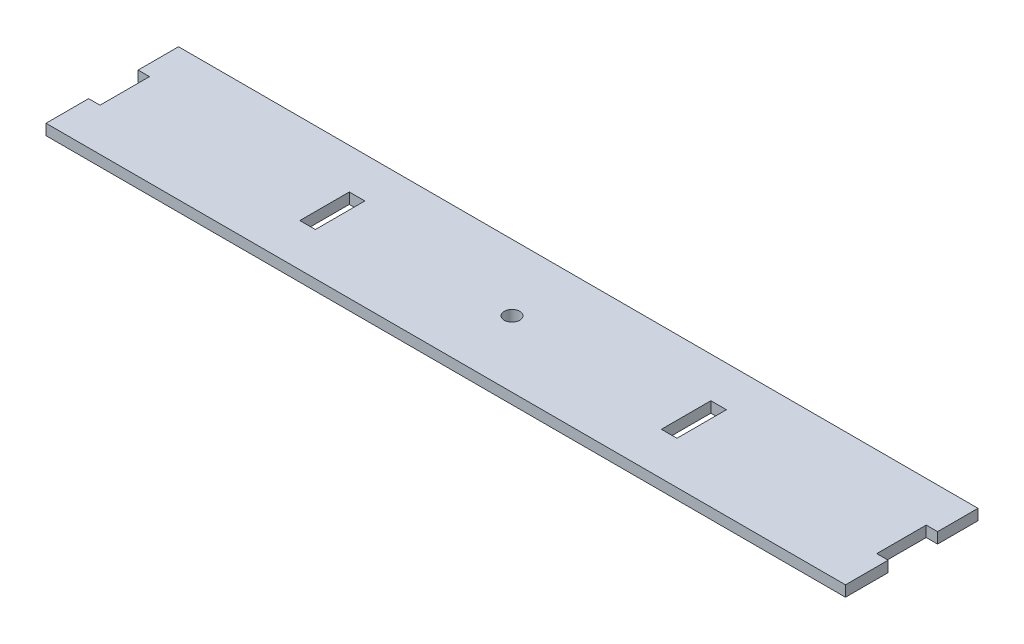
ISO-10303-21;
HEADER;
FILE_DESCRIPTION(('STEP AP214'),'2;1');
FILE_NAME('part.step','',(''),(''),'','','');
FILE_SCHEMA(('AUTOMOTIVE_DESIGN { 1 0 10303 214 1 1 1 1 }'));
ENDSEC;
DATA;
#1=APPLICATION_CONTEXT('core data for automotive mechanical design processes');
#2=APPLICATION_PROTOCOL_DEFINITION('international standard','automotive_design',2000,#1);
#3=PRODUCT_CONTEXT('',#1,'mechanical');
#4=PRODUCT('Part','Part','',(#3));
#5=PRODUCT_RELATED_PRODUCT_CATEGORY('part','',(#4));
#6=PRODUCT_DEFINITION_FORMATION('','',#4);
#7=PRODUCT_DEFINITION_CONTEXT('part definition',#1,'design');
#8=PRODUCT_DEFINITION('design','',#6,#7);
#9=PRODUCT_DEFINITION_SHAPE('','',#8);
#10=(LENGTH_UNIT() NAMED_UNIT(*) SI_UNIT(.MILLI.,.METRE.));
#11=(NAMED_UNIT(*) PLANE_ANGLE_UNIT() SI_UNIT($,.RADIAN.));
#12=(NAMED_UNIT(*) SI_UNIT($,.STERADIAN.) SOLID_ANGLE_UNIT());
#13=UNCERTAINTY_MEASURE_WITH_UNIT(LENGTH_MEASURE(1.E-05),#10,'distance_accuracy_value','');
#14=(GEOMETRIC_REPRESENTATION_CONTEXT(3) GLOBAL_UNCERTAINTY_ASSIGNED_CONTEXT((#13)) GLOBAL_UNIT_ASSIGNED_CONTEXT((#10,
#11,#12)) REPRESENTATION_CONTEXT('',''));
#15=CARTESIAN_POINT('',(0.,0.,0.));
#16=DIRECTION('',(0.,0.,1.));
#17=DIRECTION('',(1.,0.,0.));
#18=AXIS2_PLACEMENT_3D('',#15,#16,#17);
#19=CARTESIAN_POINT('',(0.,4.7625,0.));
#20=DIRECTION('',(0.,1.,0.));
#21=DIRECTION('',(0.,0.,1.));
#22=AXIS2_PLACEMENT_3D('',#19,#20,#21);
#23=PLANE('',#22);
#24=CARTESIAN_POINT('',(0.,4.76250000000001,0.));
#25=DIRECTION('',(0.,-1.,0.));
#26=DIRECTION('',(0.,0.,-1.));
#27=AXIS2_PLACEMENT_3D('',#24,#25,#26);
#28=CIRCLE('',#27,3.429);
#29=CARTESIAN_POINT('',(0.,4.76250000000001,-3.429));
#30=VERTEX_POINT('',#29);
#31=EDGE_CURVE('E198',#30,#30,#28,.T.);
#32=ORIENTED_EDGE('',*,*,#31,.T.);
#33=EDGE_LOOP('',(#32));
#34=FACE_BOUND('',#33,.T.);
#35=DIRECTION('',(0.,0.,1.));
#36=VECTOR('',#35,1.);
#37=CARTESIAN_POINT('',(83.1215,4.76250000000001,-11.392929343963));
#38=LINE('',#37,#36);
#39=CARTESIAN_POINT('',(83.1215,4.76250000000001,-11.392929343963));
#40=VERTEX_POINT('',#39);
#41=CARTESIAN_POINT('',(83.1215,4.76250000000001,10.414));
#42=VERTEX_POINT('',#41);
#43=EDGE_CURVE('E175',#40,#42,#38,.T.);
#44=ORIENTED_EDGE('',*,*,#43,.T.);
#45=DIRECTION('',(-1.,0.,0.));
#46=VECTOR('',#45,1.);
#47=CARTESIAN_POINT('',(75.946,4.7625,10.414));
#48=LINE('',#47,#46);
#49=CARTESIAN_POINT('',(76.2635,4.7625,10.414));
#50=VERTEX_POINT('',#49);
#51=EDGE_CURVE('E181',#42,#50,#48,.T.);
#52=ORIENTED_EDGE('',*,*,#51,.T.);
#53=DIRECTION('',(0.,0.,1.));
#54=VECTOR('',#53,1.);
#55=CARTESIAN_POINT('',(76.2635,4.7625,-11.392929343963));
#56=LINE('',#55,#54);
#57=CARTESIAN_POINT('',(76.2635,4.7625,-11.392929343963));
#58=VERTEX_POINT('',#57);
#59=EDGE_CURVE('E177',#58,#50,#56,.T.);
#60=ORIENTED_EDGE('',*,*,#59,.F.);
#61=DIRECTION('',(1.,0.,0.));
#62=VECTOR('',#61,1.);
#63=CARTESIAN_POINT('',(75.946,4.7625,-11.392929343963));
#64=LINE('',#63,#62);
#65=EDGE_CURVE('E171',#58,#40,#64,.T.);
#66=ORIENTED_EDGE('',*,*,#65,.T.);
#67=EDGE_LOOP('',(#44,#52,#60,#66));
#68=FACE_BOUND('',#67,.T.);
#69=DIRECTION('',(0.,0.,-1.));
#70=VECTOR('',#69,1.);
#71=CARTESIAN_POINT('',(-83.1215,4.76250000000001,-11.392929343963));
#72=LINE('',#71,#70);
#73=CARTESIAN_POINT('',(-83.1215,4.76250000000001,10.414));
#74=VERTEX_POINT('',#73);
#75=CARTESIAN_POINT('',(-83.1215,4.76250000000001,-11.392929343963));
#76=VERTEX_POINT('',#75);
#77=EDGE_CURVE('E206',#74,#76,#72,.T.);
#78=ORIENTED_EDGE('',*,*,#77,.T.);
#79=DIRECTION('',(1.,0.,0.));
#80=VECTOR('',#79,1.);
#81=CARTESIAN_POINT('',(-82.804,4.7625,-11.392929343963));
#82=LINE('',#81,#80);
#83=CARTESIAN_POINT('',(-76.2635,4.7625,-11.392929343963));
#84=VERTEX_POINT('',#83);
#85=EDGE_CURVE('E280',#76,#84,#82,.T.);
#86=ORIENTED_EDGE('',*,*,#85,.T.);
#87=DIRECTION('',(0.,0.,-1.));
#88=VECTOR('',#87,1.);
#89=CARTESIAN_POINT('',(-76.2635,4.7625,-11.392929343963));
#90=LINE('',#89,#88);
#91=CARTESIAN_POINT('',(-76.2635,4.76250000000001,10.414));
#92=VERTEX_POINT('',#91);
#93=EDGE_CURVE('E50',#92,#84,#90,.T.);
#94=ORIENTED_EDGE('',*,*,#93,.F.);
#95=DIRECTION('',(-1.,0.,0.));
#96=VECTOR('',#95,1.);
#97=CARTESIAN_POINT('',(-82.804,4.7625,10.414));
#98=LINE('',#97,#96);
#99=EDGE_CURVE('E180',#92,#74,#98,.T.);
#100=ORIENTED_EDGE('',*,*,#99,.T.);
#101=EDGE_LOOP('',(#78,#86,#94,#100));
#102=FACE_BOUND('',#101,.T.);
#103=DIRECTION('',(-1.,0.,0.));
#104=VECTOR('',#103,1.);
#105=CARTESIAN_POINT('',(-171.196,4.7625,10.414));
#106=LINE('',#105,#104);
#107=CARTESIAN_POINT('',(-171.196,4.7625,10.414));
#108=VERTEX_POINT('',#107);
#109=CARTESIAN_POINT('',(-176.2125,4.7625,10.414));
#110=VERTEX_POINT('',#109);
#111=EDGE_CURVE('E288',#108,#110,#106,.T.);
#112=ORIENTED_EDGE('',*,*,#111,.T.);
#113=DIRECTION('',(0.,0.,-1.));
#114=VECTOR('',#113,1.);
#115=CARTESIAN_POINT('',(-176.2125,4.7625,0.));
#116=LINE('',#115,#114);
#117=CARTESIAN_POINT('',(-176.2125,4.7625,29.21));
#118=VERTEX_POINT('',#117);
#119=EDGE_CURVE('E234',#118,#110,#116,.T.);
#120=ORIENTED_EDGE('',*,*,#119,.F.);
#121=DIRECTION('',(1.,0.,0.));
#122=VECTOR('',#121,1.);
#123=CARTESIAN_POINT('',(-177.8,4.7625,29.21));
#124=LINE('',#123,#122);
#125=CARTESIAN_POINT('',(176.2125,4.7625,29.21));
#126=VERTEX_POINT('',#125);
#127=EDGE_CURVE('E281',#118,#126,#124,.T.);
#128=ORIENTED_EDGE('',*,*,#127,.T.);
#129=DIRECTION('',(0.,0.,1.));
#130=VECTOR('',#129,1.);
#131=CARTESIAN_POINT('',(176.2125,4.7625,0.));
#132=LINE('',#131,#130);
#133=CARTESIAN_POINT('',(176.2125,4.7625,10.414));
#134=VERTEX_POINT('',#133);
#135=EDGE_CURVE('E254',#134,#126,#132,.T.);
#136=ORIENTED_EDGE('',*,*,#135,.F.);
#137=DIRECTION('',(-1.,0.,0.));
#138=VECTOR('',#137,1.);
#139=CARTESIAN_POINT('',(171.196,4.7625,10.414));
#140=LINE('',#139,#138);
#141=CARTESIAN_POINT('',(171.196,4.7625,10.414));
#142=VERTEX_POINT('',#141);
#143=EDGE_CURVE('E37',#134,#142,#140,.T.);
#144=ORIENTED_EDGE('',*,*,#143,.T.);
#145=DIRECTION('',(0.,0.,-1.));
#146=VECTOR('',#145,1.);
#147=CARTESIAN_POINT('',(171.196,4.7625,10.414));
#148=LINE('',#147,#146);
#149=CARTESIAN_POINT('',(171.196,4.7625,-11.3929293439582));
#150=VERTEX_POINT('',#149);
#151=EDGE_CURVE('E332',#142,#150,#148,.T.);
#152=ORIENTED_EDGE('',*,*,#151,.T.);
#153=DIRECTION('',(1.,0.,0.));
#154=VECTOR('',#153,1.);
#155=CARTESIAN_POINT('',(171.196,4.7625,-11.3929293439582));
#156=LINE('',#155,#154);
#157=CARTESIAN_POINT('',(176.2125,4.7625,-11.3929293439582));
#158=VERTEX_POINT('',#157);
#159=EDGE_CURVE('E312',#150,#158,#156,.T.);
#160=ORIENTED_EDGE('',*,*,#159,.T.);
#161=DIRECTION('',(0.,0.,1.));
#162=VECTOR('',#161,1.);
#163=CARTESIAN_POINT('',(176.2125,4.7625,0.));
#164=LINE('',#163,#162);
#165=CARTESIAN_POINT('',(176.2125,4.7625,-29.21));
#166=VERTEX_POINT('',#165);
#167=EDGE_CURVE('E266',#166,#158,#164,.T.);
#168=ORIENTED_EDGE('',*,*,#167,.F.);
#169=DIRECTION('',(-1.,0.,0.));
#170=VECTOR('',#169,1.);
#171=CARTESIAN_POINT('',(-177.8,4.7625,-29.21));
#172=LINE('',#171,#170);
#173=CARTESIAN_POINT('',(-176.2125,4.7625,-29.21));
#174=VERTEX_POINT('',#173);
#175=EDGE_CURVE('E294',#166,#174,#172,.T.);
#176=ORIENTED_EDGE('',*,*,#175,.T.);
#177=DIRECTION('',(0.,0.,-1.));
#178=VECTOR('',#177,1.);
#179=CARTESIAN_POINT('',(-176.2125,4.7625,0.));
#180=LINE('',#179,#178);
#181=CARTESIAN_POINT('',(-176.2125,4.7625,-11.392929343963));
#182=VERTEX_POINT('',#181);
#183=EDGE_CURVE('E244',#182,#174,#180,.T.);
#184=ORIENTED_EDGE('',*,*,#183,.F.);
#185=DIRECTION('',(1.,0.,0.));
#186=VECTOR('',#185,1.);
#187=CARTESIAN_POINT('',(-171.196,4.7625,-11.392929343963));
#188=LINE('',#187,#186);
#189=CARTESIAN_POINT('',(-171.196,4.7625,-11.392929343963));
#190=VERTEX_POINT('',#189);
#191=EDGE_CURVE('E292',#182,#190,#188,.T.);
#192=ORIENTED_EDGE('',*,*,#191,.T.);
#193=DIRECTION('',(0.,0.,1.));
#194=VECTOR('',#193,1.);
#195=CARTESIAN_POINT('',(-171.196,4.7625,10.414));
#196=LINE('',#195,#194);
#197=EDGE_CURVE('E291',#190,#108,#196,.T.);
#198=ORIENTED_EDGE('',*,*,#197,.T.);
#199=EDGE_LOOP('',(#112,#120,#128,#136,#144,#152,#160,#168,#176,#184,#192,#198));
#200=FACE_BOUND('',#199,.T.);
#201=ADVANCED_FACE('F33',(#34,#68,#102,#200),#23,.T.);
#202=CARTESIAN_POINT('',(0.,0.,0.));
#203=DIRECTION('',(0.,1.,0.));
#204=DIRECTION('',(0.,0.,1.));
#205=AXIS2_PLACEMENT_3D('',#202,#203,#204);
#206=PLANE('',#205);
#207=CARTESIAN_POINT('',(0.,0.,0.));
#208=DIRECTION('',(0.,-1.,0.));
#209=DIRECTION('',(0.,0.,-1.));
#210=AXIS2_PLACEMENT_3D('',#207,#208,#209);
#211=CIRCLE('',#210,3.429);
#212=CARTESIAN_POINT('',(0.,0.,-3.429));
#213=VERTEX_POINT('',#212);
#214=EDGE_CURVE('E201',#213,#213,#211,.T.);
#215=ORIENTED_EDGE('',*,*,#214,.F.);
#216=EDGE_LOOP('',(#215));
#217=FACE_BOUND('',#216,.T.);
#218=DIRECTION('',(1.,0.,0.));
#219=VECTOR('',#218,1.);
#220=CARTESIAN_POINT('',(-82.804,0.,-11.392929343963));
#221=LINE('',#220,#219);
#222=CARTESIAN_POINT('',(-83.1215,0.,-11.392929343963));
#223=VERTEX_POINT('',#222);
#224=CARTESIAN_POINT('',(-76.2635,0.,-11.392929343963));
#225=VERTEX_POINT('',#224);
#226=EDGE_CURVE('E285',#223,#225,#221,.T.);
#227=ORIENTED_EDGE('',*,*,#226,.F.);
#228=DIRECTION('',(0.,0.,-1.));
#229=VECTOR('',#228,1.);
#230=CARTESIAN_POINT('',(-83.1215,0.,-11.392929343963));
#231=LINE('',#230,#229);
#232=CARTESIAN_POINT('',(-83.1215,0.,10.414));
#233=VERTEX_POINT('',#232);
#234=EDGE_CURVE('E204',#233,#223,#231,.T.);
#235=ORIENTED_EDGE('',*,*,#234,.F.);
#236=DIRECTION('',(-1.,0.,0.));
#237=VECTOR('',#236,1.);
#238=CARTESIAN_POINT('',(-82.804,0.,10.414));
#239=LINE('',#238,#237);
#240=CARTESIAN_POINT('',(-76.2635,0.,10.414));
#241=VERTEX_POINT('',#240);
#242=EDGE_CURVE('E308',#241,#233,#239,.T.);
#243=ORIENTED_EDGE('',*,*,#242,.F.);
#244=DIRECTION('',(0.,0.,-1.));
#245=VECTOR('',#244,1.);
#246=CARTESIAN_POINT('',(-76.2635,0.,-11.392929343963));
#247=LINE('',#246,#245);
#248=EDGE_CURVE('E215',#241,#225,#247,.T.);
#249=ORIENTED_EDGE('',*,*,#248,.T.);
#250=EDGE_LOOP('',(#227,#235,#243,#249));
#251=FACE_BOUND('',#250,.T.);
#252=DIRECTION('',(-1.,0.,0.));
#253=VECTOR('',#252,1.);
#254=CARTESIAN_POINT('',(75.946,0.,10.414));
#255=LINE('',#254,#253);
#256=CARTESIAN_POINT('',(83.1215,0.,10.414));
#257=VERTEX_POINT('',#256);
#258=CARTESIAN_POINT('',(76.2635,0.,10.414));
#259=VERTEX_POINT('',#258);
#260=EDGE_CURVE('E283',#257,#259,#255,.T.);
#261=ORIENTED_EDGE('',*,*,#260,.F.);
#262=DIRECTION('',(0.,0.,1.));
#263=VECTOR('',#262,1.);
#264=CARTESIAN_POINT('',(83.1215,0.,-11.392929343963));
#265=LINE('',#264,#263);
#266=CARTESIAN_POINT('',(83.1215,0.,-11.392929343963));
#267=VERTEX_POINT('',#266);
#268=EDGE_CURVE('E196',#267,#257,#265,.T.);
#269=ORIENTED_EDGE('',*,*,#268,.F.);
#270=DIRECTION('',(1.,0.,0.));
#271=VECTOR('',#270,1.);
#272=CARTESIAN_POINT('',(75.946,0.,-11.392929343963));
#273=LINE('',#272,#271);
#274=CARTESIAN_POINT('',(76.2635,0.,-11.392929343963));
#275=VERTEX_POINT('',#274);
#276=EDGE_CURVE('E187',#275,#267,#273,.T.);
#277=ORIENTED_EDGE('',*,*,#276,.F.);
#278=DIRECTION('',(0.,0.,1.));
#279=VECTOR('',#278,1.);
#280=CARTESIAN_POINT('',(76.2635,0.,-11.392929343963));
#281=LINE('',#280,#279);
#282=EDGE_CURVE('E224',#275,#259,#281,.T.);
#283=ORIENTED_EDGE('',*,*,#282,.T.);
#284=EDGE_LOOP('',(#261,#269,#277,#283));
#285=FACE_BOUND('',#284,.T.);
#286=DIRECTION('',(0.,0.,-1.));
#287=VECTOR('',#286,1.);
#288=CARTESIAN_POINT('',(-176.2125,0.,0.));
#289=LINE('',#288,#287);
#290=CARTESIAN_POINT('',(-176.2125,0.,29.21));
#291=VERTEX_POINT('',#290);
#292=CARTESIAN_POINT('',(-176.2125,0.,10.414));
#293=VERTEX_POINT('',#292);
#294=EDGE_CURVE('E232',#291,#293,#289,.T.);
#295=ORIENTED_EDGE('',*,*,#294,.T.);
#296=DIRECTION('',(-1.,0.,0.));
#297=VECTOR('',#296,1.);
#298=CARTESIAN_POINT('',(-171.196,0.,10.414));
#299=LINE('',#298,#297);
#300=CARTESIAN_POINT('',(-171.196,0.,10.414));
#301=VERTEX_POINT('',#300);
#302=EDGE_CURVE('E297',#301,#293,#299,.T.);
#303=ORIENTED_EDGE('',*,*,#302,.F.);
#304=DIRECTION('',(0.,0.,1.));
#305=VECTOR('',#304,1.);
#306=CARTESIAN_POINT('',(-171.196,0.,10.414));
#307=LINE('',#306,#305);
#308=CARTESIAN_POINT('',(-171.196,0.,-11.392929343963));
#309=VERTEX_POINT('',#308);
#310=EDGE_CURVE('E300',#309,#301,#307,.T.);
#311=ORIENTED_EDGE('',*,*,#310,.F.);
#312=DIRECTION('',(-1.,0.,0.));
#313=VECTOR('',#312,1.);
#314=CARTESIAN_POINT('',(0.,0.,-11.392929343963));
#315=LINE('',#314,#313);
#316=CARTESIAN_POINT('',(-176.2125,0.,-11.392929343963));
#317=VERTEX_POINT('',#316);
#318=EDGE_CURVE('E279',#309,#317,#315,.T.);
#319=ORIENTED_EDGE('',*,*,#318,.T.);
#320=DIRECTION('',(0.,0.,-1.));
#321=VECTOR('',#320,1.);
#322=CARTESIAN_POINT('',(-176.2125,0.,0.));
#323=LINE('',#322,#321);
#324=CARTESIAN_POINT('',(-176.2125,0.,-29.21));
#325=VERTEX_POINT('',#324);
#326=EDGE_CURVE('E241',#317,#325,#323,.T.);
#327=ORIENTED_EDGE('',*,*,#326,.T.);
#328=DIRECTION('',(-1.,0.,0.));
#329=VECTOR('',#328,1.);
#330=CARTESIAN_POINT('',(-177.8,0.,-29.21));
#331=LINE('',#330,#329);
#332=CARTESIAN_POINT('',(176.2125,0.,-29.21));
#333=VERTEX_POINT('',#332);
#334=EDGE_CURVE('E314',#333,#325,#331,.T.);
#335=ORIENTED_EDGE('',*,*,#334,.F.);
#336=DIRECTION('',(0.,0.,1.));
#337=VECTOR('',#336,1.);
#338=CARTESIAN_POINT('',(176.2125,0.,0.));
#339=LINE('',#338,#337);
#340=CARTESIAN_POINT('',(176.2125,0.,-11.3929293439582));
#341=VERTEX_POINT('',#340);
#342=EDGE_CURVE('E263',#333,#341,#339,.T.);
#343=ORIENTED_EDGE('',*,*,#342,.T.);
#344=DIRECTION('',(1.,0.,0.));
#345=VECTOR('',#344,1.);
#346=CARTESIAN_POINT('',(171.196,0.,-11.3929293439582));
#347=LINE('',#346,#345);
#348=CARTESIAN_POINT('',(171.196,0.,-11.3929293439582));
#349=VERTEX_POINT('',#348);
#350=EDGE_CURVE('E326',#349,#341,#347,.T.);
#351=ORIENTED_EDGE('',*,*,#350,.F.);
#352=DIRECTION('',(0.,0.,-1.));
#353=VECTOR('',#352,1.);
#354=CARTESIAN_POINT('',(171.196,0.,10.414));
#355=LINE('',#354,#353);
#356=CARTESIAN_POINT('',(171.196,0.,10.414));
#357=VERTEX_POINT('',#356);
#358=EDGE_CURVE('E42',#357,#349,#355,.T.);
#359=ORIENTED_EDGE('',*,*,#358,.F.);
#360=DIRECTION('',(1.,0.,0.));
#361=VECTOR('',#360,1.);
#362=CARTESIAN_POINT('',(0.,0.,10.414));
#363=LINE('',#362,#361);
#364=CARTESIAN_POINT('',(176.2125,0.,10.414));
#365=VERTEX_POINT('',#364);
#366=EDGE_CURVE('E276',#357,#365,#363,.T.);
#367=ORIENTED_EDGE('',*,*,#366,.T.);
#368=DIRECTION('',(0.,0.,1.));
#369=VECTOR('',#368,1.);
#370=CARTESIAN_POINT('',(176.2125,0.,0.));
#371=LINE('',#370,#369);
#372=CARTESIAN_POINT('',(176.2125,0.,29.21));
#373=VERTEX_POINT('',#372);
#374=EDGE_CURVE('E251',#365,#373,#371,.T.);
#375=ORIENTED_EDGE('',*,*,#374,.T.);
#376=DIRECTION('',(1.,0.,0.));
#377=VECTOR('',#376,1.);
#378=CARTESIAN_POINT('',(-177.8,0.,29.21));
#379=LINE('',#378,#377);
#380=EDGE_CURVE('E273',#291,#373,#379,.T.);
#381=ORIENTED_EDGE('',*,*,#380,.F.);
#382=EDGE_LOOP('',(#295,#303,#311,#319,#327,#335,#343,#351,#359,#367,#375,#381));
#383=FACE_BOUND('',#382,.T.);
#384=ADVANCED_FACE('F35',(#217,#251,#285,#383),#206,.F.);
#385=CARTESIAN_POINT('',(-177.8,4.7625,29.21));
#386=DIRECTION('',(0.,0.,-1.));
#387=DIRECTION('',(-1.,0.,0.));
#388=AXIS2_PLACEMENT_3D('',#385,#386,#387);
#389=PLANE('',#388);
#390=DIRECTION('',(0.,-1.,0.));
#391=VECTOR('',#390,1.);
#392=CARTESIAN_POINT('',(-176.2125,4.7625,29.21));
#393=LINE('',#392,#391);
#394=EDGE_CURVE('E236',#118,#291,#393,.T.);
#395=ORIENTED_EDGE('',*,*,#394,.T.);
#396=ORIENTED_EDGE('',*,*,#380,.T.);
#397=DIRECTION('',(0.,-1.,0.));
#398=VECTOR('',#397,1.);
#399=CARTESIAN_POINT('',(176.2125,4.7625,29.21));
#400=LINE('',#399,#398);
#401=EDGE_CURVE('E260',#126,#373,#400,.T.);
#402=ORIENTED_EDGE('',*,*,#401,.F.);
#403=ORIENTED_EDGE('',*,*,#127,.F.);
#404=EDGE_LOOP('',(#395,#396,#402,#403));
#405=FACE_BOUND('',#404,.T.);
#406=ADVANCED_FACE('F381',(#405),#389,.F.);
#407=CARTESIAN_POINT('',(-171.196,4.7625,10.414));
#408=DIRECTION('',(0.,0.,1.));
#409=DIRECTION('',(1.,0.,0.));
#410=AXIS2_PLACEMENT_3D('',#407,#408,#409);
#411=PLANE('',#410);
#412=DIRECTION('',(0.,-1.,0.));
#413=VECTOR('',#412,1.);
#414=CARTESIAN_POINT('',(-176.2125,4.7625,10.414));
#415=LINE('',#414,#413);
#416=EDGE_CURVE('E239',#110,#293,#415,.T.);
#417=ORIENTED_EDGE('',*,*,#416,.F.);
#418=ORIENTED_EDGE('',*,*,#111,.F.);
#419=DIRECTION('',(0.,-1.,0.));
#420=VECTOR('',#419,1.);
#421=CARTESIAN_POINT('',(-171.196,4.7625,10.414));
#422=LINE('',#421,#420);
#423=EDGE_CURVE('E301',#108,#301,#422,.T.);
#424=ORIENTED_EDGE('',*,*,#423,.T.);
#425=ORIENTED_EDGE('',*,*,#302,.T.);
#426=EDGE_LOOP('',(#417,#418,#424,#425));
#427=FACE_BOUND('',#426,.T.);
#428=ADVANCED_FACE('F375',(#427),#411,.F.);
#429=CARTESIAN_POINT('',(-177.8,4.7625,-29.21));
#430=DIRECTION('',(0.,0.,1.));
#431=DIRECTION('',(1.,0.,0.));
#432=AXIS2_PLACEMENT_3D('',#429,#430,#431);
#433=PLANE('',#432);
#434=DIRECTION('',(0.,-1.,0.));
#435=VECTOR('',#434,1.);
#436=CARTESIAN_POINT('',(-176.2125,4.7625,-29.21));
#437=LINE('',#436,#435);
#438=EDGE_CURVE('E249',#174,#325,#437,.T.);
#439=ORIENTED_EDGE('',*,*,#438,.F.);
#440=ORIENTED_EDGE('',*,*,#175,.F.);
#441=DIRECTION('',(0.,-1.,0.));
#442=VECTOR('',#441,1.);
#443=CARTESIAN_POINT('',(176.2125,4.7625,-29.21));
#444=LINE('',#443,#442);
#445=EDGE_CURVE('E268',#166,#333,#444,.T.);
#446=ORIENTED_EDGE('',*,*,#445,.T.);
#447=ORIENTED_EDGE('',*,*,#334,.T.);
#448=EDGE_LOOP('',(#439,#440,#446,#447));
#449=FACE_BOUND('',#448,.T.);
#450=ADVANCED_FACE('F356',(#449),#433,.F.);
#451=CARTESIAN_POINT('',(-171.196,4.7625,-11.392929343963));
#452=DIRECTION('',(0.,0.,-1.));
#453=DIRECTION('',(-1.,0.,0.));
#454=AXIS2_PLACEMENT_3D('',#451,#452,#453);
#455=PLANE('',#454);
#456=DIRECTION('',(0.,-1.,0.));
#457=VECTOR('',#456,1.);
#458=CARTESIAN_POINT('',(-176.2125,4.7625,-11.392929343963));
#459=LINE('',#458,#457);
#460=EDGE_CURVE('E246',#182,#317,#459,.T.);
#461=ORIENTED_EDGE('',*,*,#460,.T.);
#462=ORIENTED_EDGE('',*,*,#318,.F.);
#463=DIRECTION('',(0.,-1.,0.));
#464=VECTOR('',#463,1.);
#465=CARTESIAN_POINT('',(-171.196,4.7625,-11.392929343963));
#466=LINE('',#465,#464);
#467=EDGE_CURVE('E304',#190,#309,#466,.T.);
#468=ORIENTED_EDGE('',*,*,#467,.F.);
#469=ORIENTED_EDGE('',*,*,#191,.F.);
#470=EDGE_LOOP('',(#461,#462,#468,#469));
#471=FACE_BOUND('',#470,.T.);
#472=ADVANCED_FACE('F365',(#471),#455,.F.);
#473=CARTESIAN_POINT('',(171.196,4.7625,10.414));
#474=DIRECTION('',(0.,0.,1.));
#475=DIRECTION('',(1.,0.,0.));
#476=AXIS2_PLACEMENT_3D('',#473,#474,#475);
#477=PLANE('',#476);
#478=DIRECTION('',(0.,-1.,0.));
#479=VECTOR('',#478,1.);
#480=CARTESIAN_POINT('',(176.2125,4.7625,10.414));
#481=LINE('',#480,#479);
#482=EDGE_CURVE('E257',#134,#365,#481,.T.);
#483=ORIENTED_EDGE('',*,*,#482,.T.);
#484=ORIENTED_EDGE('',*,*,#366,.F.);
#485=DIRECTION('',(0.,-1.,0.));
#486=VECTOR('',#485,1.);
#487=CARTESIAN_POINT('',(171.196,4.7625,10.414));
#488=LINE('',#487,#486);
#489=EDGE_CURVE('E11',#142,#357,#488,.T.);
#490=ORIENTED_EDGE('',*,*,#489,.F.);
#491=ORIENTED_EDGE('',*,*,#143,.F.);
#492=EDGE_LOOP('',(#483,#484,#490,#491));
#493=FACE_BOUND('',#492,.T.);
#494=ADVANCED_FACE('F341',(#493),#477,.F.);
#495=CARTESIAN_POINT('',(171.196,4.7625,-11.3929293439582));
#496=DIRECTION('',(0.,0.,-1.));
#497=DIRECTION('',(-1.,0.,0.));
#498=AXIS2_PLACEMENT_3D('',#495,#496,#497);
#499=PLANE('',#498);
#500=DIRECTION('',(0.,-1.,0.));
#501=VECTOR('',#500,1.);
#502=CARTESIAN_POINT('',(176.2125,4.7625,-11.3929293439582));
#503=LINE('',#502,#501);
#504=EDGE_CURVE('E271',#158,#341,#503,.T.);
#505=ORIENTED_EDGE('',*,*,#504,.F.);
#506=ORIENTED_EDGE('',*,*,#159,.F.);
#507=DIRECTION('',(0.,-1.,0.));
#508=VECTOR('',#507,1.);
#509=CARTESIAN_POINT('',(171.196,4.7625,-11.3929293439582));
#510=LINE('',#509,#508);
#511=EDGE_CURVE('E287',#150,#349,#510,.T.);
#512=ORIENTED_EDGE('',*,*,#511,.T.);
#513=ORIENTED_EDGE('',*,*,#350,.T.);
#514=EDGE_LOOP('',(#505,#506,#512,#513));
#515=FACE_BOUND('',#514,.T.);
#516=ADVANCED_FACE('F349',(#515),#499,.F.);
#517=CARTESIAN_POINT('',(-171.196,4.7625,10.414));
#518=DIRECTION('',(1.,0.,0.));
#519=DIRECTION('',(0.,0.,-1.));
#520=AXIS2_PLACEMENT_3D('',#517,#518,#519);
#521=PLANE('',#520);
#522=ORIENTED_EDGE('',*,*,#310,.T.);
#523=ORIENTED_EDGE('',*,*,#423,.F.);
#524=ORIENTED_EDGE('',*,*,#197,.F.);
#525=ORIENTED_EDGE('',*,*,#467,.T.);
#526=EDGE_LOOP('',(#522,#523,#524,#525));
#527=FACE_BOUND('',#526,.T.);
#528=ADVANCED_FACE('F369',(#527),#521,.F.);
#529=CARTESIAN_POINT('',(-82.804,4.7625,10.414));
#530=DIRECTION('',(0.,0.,1.));
#531=DIRECTION('',(1.,0.,0.));
#532=AXIS2_PLACEMENT_3D('',#529,#530,#531);
#533=PLANE('',#532);
#534=ORIENTED_EDGE('',*,*,#99,.F.);
#535=DIRECTION('',(0.,-1.,0.));
#536=VECTOR('',#535,1.);
#537=CARTESIAN_POINT('',(-76.2635,26.5717405567593,10.414));
#538=LINE('',#537,#536);
#539=EDGE_CURVE('E220',#92,#241,#538,.T.);
#540=ORIENTED_EDGE('',*,*,#539,.T.);
#541=ORIENTED_EDGE('',*,*,#242,.T.);
#542=DIRECTION('',(0.,-1.,0.));
#543=VECTOR('',#542,1.);
#544=CARTESIAN_POINT('',(-83.1215,4.76250000000001,10.414));
#545=LINE('',#544,#543);
#546=EDGE_CURVE('E209',#74,#233,#545,.T.);
#547=ORIENTED_EDGE('',*,*,#546,.F.);
#548=EDGE_LOOP('',(#534,#540,#541,#547));
#549=FACE_BOUND('',#548,.T.);
#550=ADVANCED_FACE('F411',(#549),#533,.F.);
#551=CARTESIAN_POINT('',(-82.804,4.7625,-11.392929343963));
#552=DIRECTION('',(0.,0.,-1.));
#553=DIRECTION('',(-1.,0.,0.));
#554=AXIS2_PLACEMENT_3D('',#551,#552,#553);
#555=PLANE('',#554);
#556=ORIENTED_EDGE('',*,*,#226,.T.);
#557=DIRECTION('',(0.,-1.,0.));
#558=VECTOR('',#557,1.);
#559=CARTESIAN_POINT('',(-76.2635,26.5717405567593,-11.392929343963));
#560=LINE('',#559,#558);
#561=EDGE_CURVE('E222',#84,#225,#560,.T.);
#562=ORIENTED_EDGE('',*,*,#561,.F.);
#563=ORIENTED_EDGE('',*,*,#85,.F.);
#564=DIRECTION('',(0.,-1.,0.));
#565=VECTOR('',#564,1.);
#566=CARTESIAN_POINT('',(-83.1215,4.76250000000001,-11.392929343963));
#567=LINE('',#566,#565);
#568=EDGE_CURVE('E212',#76,#223,#567,.T.);
#569=ORIENTED_EDGE('',*,*,#568,.T.);
#570=EDGE_LOOP('',(#556,#562,#563,#569));
#571=FACE_BOUND('',#570,.T.);
#572=ADVANCED_FACE('F407',(#571),#555,.F.);
#573=CARTESIAN_POINT('',(75.946,4.7625,10.414));
#574=DIRECTION('',(0.,0.,1.));
#575=DIRECTION('',(1.,0.,0.));
#576=AXIS2_PLACEMENT_3D('',#573,#574,#575);
#577=PLANE('',#576);
#578=ORIENTED_EDGE('',*,*,#260,.T.);
#579=DIRECTION('',(0.,-1.,0.));
#580=VECTOR('',#579,1.);
#581=CARTESIAN_POINT('',(76.2635,26.5717405567593,10.414));
#582=LINE('',#581,#580);
#583=EDGE_CURVE('E58',#50,#259,#582,.T.);
#584=ORIENTED_EDGE('',*,*,#583,.F.);
#585=ORIENTED_EDGE('',*,*,#51,.F.);
#586=DIRECTION('',(0.,-1.,0.));
#587=VECTOR('',#586,1.);
#588=CARTESIAN_POINT('',(83.1215,4.76250000000001,10.414));
#589=LINE('',#588,#587);
#590=EDGE_CURVE('E191',#42,#257,#589,.T.);
#591=ORIENTED_EDGE('',*,*,#590,.T.);
#592=EDGE_LOOP('',(#578,#584,#585,#591));
#593=FACE_BOUND('',#592,.T.);
#594=ADVANCED_FACE('F410',(#593),#577,.F.);
#595=CARTESIAN_POINT('',(75.946,4.7625,-11.392929343963));
#596=DIRECTION('',(0.,0.,-1.));
#597=DIRECTION('',(-1.,0.,0.));
#598=AXIS2_PLACEMENT_3D('',#595,#596,#597);
#599=PLANE('',#598);
#600=ORIENTED_EDGE('',*,*,#65,.F.);
#601=DIRECTION('',(0.,-1.,0.));
#602=VECTOR('',#601,1.);
#603=CARTESIAN_POINT('',(76.2635,26.5717405567593,-11.392929343963));
#604=LINE('',#603,#602);
#605=EDGE_CURVE('E229',#58,#275,#604,.T.);
#606=ORIENTED_EDGE('',*,*,#605,.T.);
#607=ORIENTED_EDGE('',*,*,#276,.T.);
#608=DIRECTION('',(0.,-1.,0.));
#609=VECTOR('',#608,1.);
#610=CARTESIAN_POINT('',(83.1215,4.76250000000001,-11.392929343963));
#611=LINE('',#610,#609);
#612=EDGE_CURVE('E184',#40,#267,#611,.T.);
#613=ORIENTED_EDGE('',*,*,#612,.F.);
#614=EDGE_LOOP('',(#600,#606,#607,#613));
#615=FACE_BOUND('',#614,.T.);
#616=ADVANCED_FACE('F185',(#615),#599,.F.);
#617=CARTESIAN_POINT('',(171.196,4.7625,10.414));
#618=DIRECTION('',(-1.,0.,0.));
#619=DIRECTION('',(0.,0.,1.));
#620=AXIS2_PLACEMENT_3D('',#617,#618,#619);
#621=PLANE('',#620);
#622=ORIENTED_EDGE('',*,*,#358,.T.);
#623=ORIENTED_EDGE('',*,*,#511,.F.);
#624=ORIENTED_EDGE('',*,*,#151,.F.);
#625=ORIENTED_EDGE('',*,*,#489,.T.);
#626=EDGE_LOOP('',(#622,#623,#624,#625));
#627=FACE_BOUND('',#626,.T.);
#628=ADVANCED_FACE('F344',(#627),#621,.F.);
#629=CARTESIAN_POINT('',(176.2125,4.7625,0.));
#630=DIRECTION('',(1.,0.,0.));
#631=DIRECTION('',(0.,0.,-1.));
#632=AXIS2_PLACEMENT_3D('',#629,#630,#631);
#633=PLANE('',#632);
#634=ORIENTED_EDGE('',*,*,#342,.F.);
#635=ORIENTED_EDGE('',*,*,#445,.F.);
#636=ORIENTED_EDGE('',*,*,#167,.T.);
#637=ORIENTED_EDGE('',*,*,#504,.T.);
#638=EDGE_LOOP('',(#634,#635,#636,#637));
#639=FACE_BOUND('',#638,.T.);
#640=ADVANCED_FACE('F384',(#639),#633,.T.);
#641=CARTESIAN_POINT('',(176.2125,4.7625,0.));
#642=DIRECTION('',(1.,0.,0.));
#643=DIRECTION('',(0.,0.,-1.));
#644=AXIS2_PLACEMENT_3D('',#641,#642,#643);
#645=PLANE('',#644);
#646=ORIENTED_EDGE('',*,*,#374,.F.);
#647=ORIENTED_EDGE('',*,*,#482,.F.);
#648=ORIENTED_EDGE('',*,*,#135,.T.);
#649=ORIENTED_EDGE('',*,*,#401,.T.);
#650=EDGE_LOOP('',(#646,#647,#648,#649));
#651=FACE_BOUND('',#650,.T.);
#652=ADVANCED_FACE('F383',(#651),#645,.T.);
#653=CARTESIAN_POINT('',(-176.2125,4.7625,0.));
#654=DIRECTION('',(-1.,0.,0.));
#655=DIRECTION('',(0.,0.,1.));
#656=AXIS2_PLACEMENT_3D('',#653,#654,#655);
#657=PLANE('',#656);
#658=ORIENTED_EDGE('',*,*,#326,.F.);
#659=ORIENTED_EDGE('',*,*,#460,.F.);
#660=ORIENTED_EDGE('',*,*,#183,.T.);
#661=ORIENTED_EDGE('',*,*,#438,.T.);
#662=EDGE_LOOP('',(#658,#659,#660,#661));
#663=FACE_BOUND('',#662,.T.);
#664=ADVANCED_FACE('F359',(#663),#657,.T.);
#665=CARTESIAN_POINT('',(-176.2125,4.7625,0.));
#666=DIRECTION('',(-1.,0.,0.));
#667=DIRECTION('',(0.,0.,1.));
#668=AXIS2_PLACEMENT_3D('',#665,#666,#667);
#669=PLANE('',#668);
#670=ORIENTED_EDGE('',*,*,#294,.F.);
#671=ORIENTED_EDGE('',*,*,#394,.F.);
#672=ORIENTED_EDGE('',*,*,#119,.T.);
#673=ORIENTED_EDGE('',*,*,#416,.T.);
#674=EDGE_LOOP('',(#670,#671,#672,#673));
#675=FACE_BOUND('',#674,.T.);
#676=ADVANCED_FACE('F377',(#675),#669,.T.);
#677=CARTESIAN_POINT('',(76.2635,26.5717405567593,-11.392929343963));
#678=DIRECTION('',(1.,0.,0.));
#679=DIRECTION('',(0.,0.,-1.));
#680=AXIS2_PLACEMENT_3D('',#677,#678,#679);
#681=PLANE('',#680);
#682=ORIENTED_EDGE('',*,*,#605,.F.);
#683=ORIENTED_EDGE('',*,*,#59,.T.);
#684=ORIENTED_EDGE('',*,*,#583,.T.);
#685=ORIENTED_EDGE('',*,*,#282,.F.);
#686=EDGE_LOOP('',(#682,#683,#684,#685));
#687=FACE_BOUND('',#686,.T.);
#688=ADVANCED_FACE('F502',(#687),#681,.T.);
#689=CARTESIAN_POINT('',(-76.2635,26.5717405567593,-11.392929343963));
#690=DIRECTION('',(-1.,0.,0.));
#691=DIRECTION('',(0.,0.,1.));
#692=AXIS2_PLACEMENT_3D('',#689,#690,#691);
#693=PLANE('',#692);
#694=ORIENTED_EDGE('',*,*,#539,.F.);
#695=ORIENTED_EDGE('',*,*,#93,.T.);
#696=ORIENTED_EDGE('',*,*,#561,.T.);
#697=ORIENTED_EDGE('',*,*,#248,.F.);
#698=EDGE_LOOP('',(#694,#695,#696,#697));
#699=FACE_BOUND('',#698,.T.);
#700=ADVANCED_FACE('F512',(#699),#693,.T.);
#701=CARTESIAN_POINT('',(-83.1215,4.76250000000001,-11.392929343963));
#702=DIRECTION('',(-1.,0.,0.));
#703=DIRECTION('',(0.,0.,1.));
#704=AXIS2_PLACEMENT_3D('',#701,#702,#703);
#705=PLANE('',#704);
#706=ORIENTED_EDGE('',*,*,#234,.T.);
#707=ORIENTED_EDGE('',*,*,#568,.F.);
#708=ORIENTED_EDGE('',*,*,#77,.F.);
#709=ORIENTED_EDGE('',*,*,#546,.T.);
#710=EDGE_LOOP('',(#706,#707,#708,#709));
#711=FACE_BOUND('',#710,.T.);
#712=ADVANCED_FACE('F523',(#711),#705,.F.);
#713=CARTESIAN_POINT('',(83.1215,4.76250000000001,-11.392929343963));
#714=DIRECTION('',(1.,0.,0.));
#715=DIRECTION('',(0.,0.,-1.));
#716=AXIS2_PLACEMENT_3D('',#713,#714,#715);
#717=PLANE('',#716);
#718=ORIENTED_EDGE('',*,*,#268,.T.);
#719=ORIENTED_EDGE('',*,*,#590,.F.);
#720=ORIENTED_EDGE('',*,*,#43,.F.);
#721=ORIENTED_EDGE('',*,*,#612,.T.);
#722=EDGE_LOOP('',(#718,#719,#720,#721));
#723=FACE_BOUND('',#722,.T.);
#724=ADVANCED_FACE('F194',(#723),#717,.F.);
#725=CARTESIAN_POINT('',(0.,4.76250000000001,0.));
#726=DIRECTION('',(0.,-1.,0.));
#727=DIRECTION('',(0.,0.,-1.));
#728=AXIS2_PLACEMENT_3D('',#725,#726,#727);
#729=CYLINDRICAL_SURFACE('',#728,3.429);
#730=ORIENTED_EDGE('',*,*,#31,.F.);
#731=EDGE_LOOP('',(#730));
#732=FACE_BOUND('',#731,.T.);
#733=ORIENTED_EDGE('',*,*,#214,.T.);
#734=EDGE_LOOP('',(#733));
#735=FACE_BOUND('',#734,.T.);
#736=ADVANCED_FACE('F564',(#732,#735),#729,.F.);
#737=CLOSED_SHELL('',(#201,#384,#406,#428,#450,#472,#494,#516,#528,#550,#572,#594,#616,#628,
#640,#652,#664,#676,#688,#700,#712,#724,#736));
#738=MANIFOLD_SOLID_BREP('B2',#737);
#739=ADVANCED_BREP_SHAPE_REPRESENTATION('',(#18,#738),#14);
#740=SHAPE_DEFINITION_REPRESENTATION(#9,#739);
ENDSEC;
END-ISO-10303-21;
